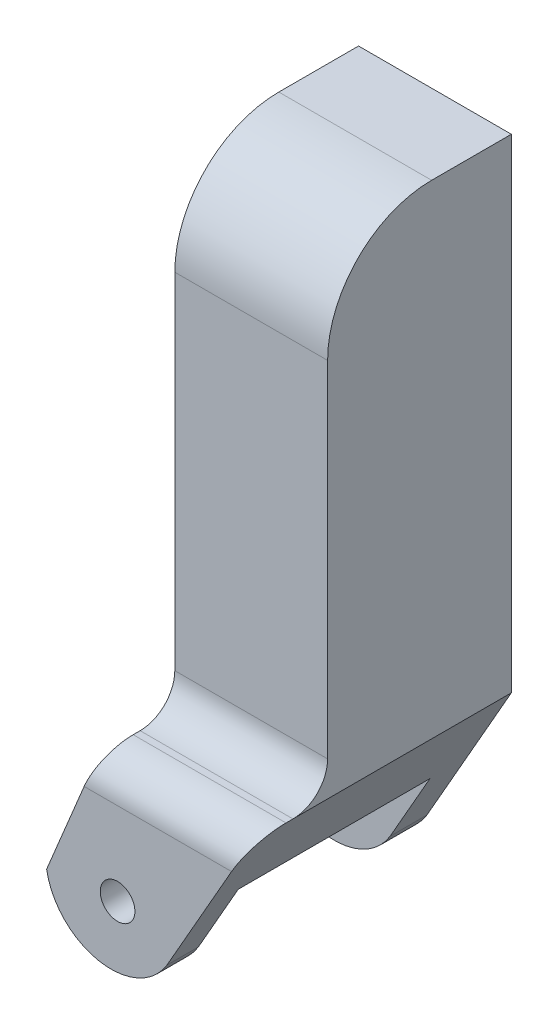
ISO-10303-21;
HEADER;
FILE_DESCRIPTION(('STEP AP214'),'2;1');
FILE_NAME('part.step','',(''),(''),'','','');
FILE_SCHEMA(('AUTOMOTIVE_DESIGN { 1 0 10303 214 1 1 1 1 }'));
ENDSEC;
DATA;
#1=APPLICATION_CONTEXT('core data for automotive mechanical design processes');
#2=APPLICATION_PROTOCOL_DEFINITION('international standard','automotive_design',2000,#1);
#3=PRODUCT_CONTEXT('',#1,'mechanical');
#4=PRODUCT('Part','Part','',(#3));
#5=PRODUCT_RELATED_PRODUCT_CATEGORY('part','',(#4));
#6=PRODUCT_DEFINITION_FORMATION('','',#4);
#7=PRODUCT_DEFINITION_CONTEXT('part definition',#1,'design');
#8=PRODUCT_DEFINITION('design','',#6,#7);
#9=PRODUCT_DEFINITION_SHAPE('','',#8);
#10=(LENGTH_UNIT() NAMED_UNIT(*) SI_UNIT(.MILLI.,.METRE.));
#11=(NAMED_UNIT(*) PLANE_ANGLE_UNIT() SI_UNIT($,.RADIAN.));
#12=(NAMED_UNIT(*) SI_UNIT($,.STERADIAN.) SOLID_ANGLE_UNIT());
#13=UNCERTAINTY_MEASURE_WITH_UNIT(LENGTH_MEASURE(1.E-05),#10,'distance_accuracy_value','');
#14=(GEOMETRIC_REPRESENTATION_CONTEXT(3) GLOBAL_UNCERTAINTY_ASSIGNED_CONTEXT((#13)) GLOBAL_UNIT_ASSIGNED_CONTEXT((#10,
#11,#12)) REPRESENTATION_CONTEXT('',''));
#15=CARTESIAN_POINT('',(0.,0.,0.));
#16=DIRECTION('',(0.,0.,1.));
#17=DIRECTION('',(1.,0.,0.));
#18=AXIS2_PLACEMENT_3D('',#15,#16,#17);
#19=CARTESIAN_POINT('',(-32.8848789360729,-92.7216774639358,53.));
#20=DIRECTION('',(0.,0.,-1.));
#21=DIRECTION('',(-1.,0.,0.));
#22=AXIS2_PLACEMENT_3D('',#19,#20,#21);
#23=CYLINDRICAL_SURFACE('',#22,18.8454114946771);
#24=DIRECTION('',(0.,0.,-1.));
#25=VECTOR('',#24,1.);
#26=CARTESIAN_POINT('',(-16.7914518301271,-102.527346150431,53.));
#27=LINE('',#26,#25);
#28=CARTESIAN_POINT('',(-16.7914518301271,-102.527346150431,10.6228361222349));
#29=VERTEX_POINT('',#28);
#30=CARTESIAN_POINT('',(-16.7914518301271,-102.527346150431,0.));
#31=VERTEX_POINT('',#30);
#32=EDGE_CURVE('E236',#29,#31,#27,.T.);
#33=ORIENTED_EDGE('',*,*,#32,.F.);
#34=CARTESIAN_POINT('',(-32.8848789360729,-92.7216774639358,10.6228361222349));
#35=DIRECTION('',(0.,0.,-1.));
#36=DIRECTION('',(-1.,0.,0.));
#37=AXIS2_PLACEMENT_3D('',#34,#35,#36);
#38=CIRCLE('',#37,18.8454114946771);
#39=CARTESIAN_POINT('',(-51.4654601740428,-95.8699365483993,10.6228361222349));
#40=VERTEX_POINT('',#39);
#41=EDGE_CURVE('E175',#29,#40,#38,.T.);
#42=ORIENTED_EDGE('',*,*,#41,.T.);
#43=DIRECTION('',(0.,0.,-1.));
#44=VECTOR('',#43,1.);
#45=CARTESIAN_POINT('',(-51.4654601740428,-95.8699365483993,53.));
#46=LINE('',#45,#44);
#47=CARTESIAN_POINT('',(-51.4654601740428,-95.8699365483993,0.));
#48=VERTEX_POINT('',#47);
#49=EDGE_CURVE('E241',#40,#48,#46,.T.);
#50=ORIENTED_EDGE('',*,*,#49,.T.);
#51=CARTESIAN_POINT('',(-32.8848789360729,-92.7216774639358,0.));
#52=DIRECTION('',(0.,0.,1.));
#53=DIRECTION('',(1.,0.,0.));
#54=AXIS2_PLACEMENT_3D('',#51,#52,#53);
#55=CIRCLE('',#54,18.8454114946771);
#56=EDGE_CURVE('E213',#48,#31,#55,.T.);
#57=ORIENTED_EDGE('',*,*,#56,.T.);
#58=EDGE_LOOP('',(#33,#42,#50,#57));
#59=FACE_BOUND('',#58,.T.);
#60=ADVANCED_FACE('F40',(#59),#23,.T.);
#61=CARTESIAN_POINT('',(-32.8848789360729,-92.7216774639358,53.));
#62=DIRECTION('',(0.,0.,1.));
#63=DIRECTION('',(1.,0.,0.));
#64=AXIS2_PLACEMENT_3D('',#61,#62,#63);
#65=PLANE('',#64);
#66=DIRECTION('',(0.,1.,0.));
#67=VECTOR('',#66,1.);
#68=CARTESIAN_POINT('',(7.58018465440707,79.732312661171,53.));
#69=LINE('',#68,#67);
#70=CARTESIAN_POINT('',(7.58018465440707,-49.7992344958783,53.));
#71=VERTEX_POINT('',#70);
#72=CARTESIAN_POINT('',(7.58018465440707,49.732312661171,53.));
#73=VERTEX_POINT('',#72);
#74=EDGE_CURVE('E200',#71,#73,#69,.T.);
#75=ORIENTED_EDGE('',*,*,#74,.T.);
#76=DIRECTION('',(-1.,0.,0.));
#77=VECTOR('',#76,1.);
#78=CARTESIAN_POINT('',(-36.4971853730712,49.732312661171,53.));
#79=LINE('',#78,#77);
#80=CARTESIAN_POINT('',(-36.4971853730712,49.732312661171,53.));
#81=VERTEX_POINT('',#80);
#82=EDGE_CURVE('E287',#73,#81,#79,.T.);
#83=ORIENTED_EDGE('',*,*,#82,.T.);
#84=DIRECTION('',(0.,-1.,0.));
#85=VECTOR('',#84,1.);
#86=CARTESIAN_POINT('',(-36.4971853730712,79.732312661171,53.));
#87=LINE('',#86,#85);
#88=CARTESIAN_POINT('',(-36.4971853730712,-49.7992344958783,53.));
#89=VERTEX_POINT('',#88);
#90=EDGE_CURVE('E197',#81,#89,#87,.T.);
#91=ORIENTED_EDGE('',*,*,#90,.T.);
#92=DIRECTION('',(1.,0.,0.));
#93=VECTOR('',#92,1.);
#94=CARTESIAN_POINT('',(7.58018465440707,-49.7992344958783,53.));
#95=LINE('',#94,#93);
#96=EDGE_CURVE('E249',#89,#71,#95,.T.);
#97=ORIENTED_EDGE('',*,*,#96,.T.);
#98=EDGE_LOOP('',(#75,#83,#91,#97));
#99=FACE_BOUND('',#98,.T.);
#100=ADVANCED_FACE('F345',(#99),#65,.T.);
#101=CARTESIAN_POINT('',(-36.4971853730712,79.732312661171,53.));
#102=DIRECTION('',(1.,0.,0.));
#103=DIRECTION('',(0.,0.,-1.));
#104=AXIS2_PLACEMENT_3D('',#101,#102,#103);
#105=PLANE('',#104);
#106=ORIENTED_EDGE('',*,*,#90,.F.);
#107=CARTESIAN_POINT('',(-36.4971853730712,49.732312661171,23.));
#108=DIRECTION('',(1.,0.,0.));
#109=DIRECTION('',(0.,0.,-1.));
#110=AXIS2_PLACEMENT_3D('',#107,#108,#109);
#111=CIRCLE('',#110,30.);
#112=CARTESIAN_POINT('',(-36.4971853730712,79.732312661171,23.));
#113=VERTEX_POINT('',#112);
#114=EDGE_CURVE('E63',#81,#113,#111,.F.);
#115=ORIENTED_EDGE('',*,*,#114,.T.);
#116=DIRECTION('',(0.,0.,-1.));
#117=VECTOR('',#116,1.);
#118=CARTESIAN_POINT('',(-36.4971853730712,79.732312661171,53.));
#119=LINE('',#118,#117);
#120=CARTESIAN_POINT('',(-36.4971853730712,79.732312661171,0.));
#121=VERTEX_POINT('',#120);
#122=EDGE_CURVE('E205',#113,#121,#119,.T.);
#123=ORIENTED_EDGE('',*,*,#122,.T.);
#124=DIRECTION('',(0.,-1.,0.));
#125=VECTOR('',#124,1.);
#126=CARTESIAN_POINT('',(-36.4971853730712,79.732312661171,0.));
#127=LINE('',#126,#125);
#128=CARTESIAN_POINT('',(-36.4971853730712,-59.7992344958783,0.));
#129=VERTEX_POINT('',#128);
#130=EDGE_CURVE('E196',#121,#129,#127,.T.);
#131=ORIENTED_EDGE('',*,*,#130,.T.);
#132=DIRECTION('',(0.,0.,-1.));
#133=VECTOR('',#132,1.);
#134=CARTESIAN_POINT('',(-36.4971853730712,-59.7992344958783,53.));
#135=LINE('',#134,#133);
#136=CARTESIAN_POINT('',(-36.4971853730712,-59.7992344958783,63.));
#137=VERTEX_POINT('',#136);
#138=EDGE_CURVE('E245',#137,#129,#135,.T.);
#139=ORIENTED_EDGE('',*,*,#138,.F.);
#140=CARTESIAN_POINT('',(-36.4971853730712,-49.7992344958783,63.));
#141=DIRECTION('',(1.,0.,0.));
#142=DIRECTION('',(0.,0.,-1.));
#143=AXIS2_PLACEMENT_3D('',#140,#141,#142);
#144=CIRCLE('',#143,10.);
#145=EDGE_CURVE('E261',#137,#89,#144,.T.);
#146=ORIENTED_EDGE('',*,*,#145,.T.);
#147=EDGE_LOOP('',(#106,#115,#123,#131,#139,#146));
#148=FACE_BOUND('',#147,.T.);
#149=ADVANCED_FACE('F342',(#148),#105,.F.);
#150=CARTESIAN_POINT('',(-36.4971853730712,-59.7992344958783,53.));
#151=DIRECTION('',(0.923632181667743,-0.383280045120647,0.));
#152=DIRECTION('',(0.383280045120647,0.923632181667743,0.));
#153=AXIS2_PLACEMENT_3D('',#150,#151,#152);
#154=PLANE('',#153);
#155=ORIENTED_EDGE('',*,*,#49,.F.);
#156=DIRECTION('',(-0.383280045120647,-0.923632181667743,0.));
#157=VECTOR('',#156,1.);
#158=CARTESIAN_POINT('',(-39.8919841927083,-67.9800554909225,10.6228361222349));
#159=LINE('',#158,#157);
#160=CARTESIAN_POINT('',(-39.8919841927083,-67.9800554909225,10.6228361222349));
#161=VERTEX_POINT('',#160);
#162=EDGE_CURVE('E163',#161,#40,#159,.T.);
#163=ORIENTED_EDGE('',*,*,#162,.F.);
#164=DIRECTION('',(0.,0.,-1.));
#165=VECTOR('',#164,1.);
#166=CARTESIAN_POINT('',(-39.8919841927083,-67.9800554909225,10.6228361222349));
#167=LINE('',#166,#165);
#168=CARTESIAN_POINT('',(-39.8919841927083,-67.9800554909225,65.9272028664468));
#169=VERTEX_POINT('',#168);
#170=EDGE_CURVE('E145',#169,#161,#167,.T.);
#171=ORIENTED_EDGE('',*,*,#170,.F.);
#172=DIRECTION('',(0.383280045120647,0.923632181667743,0.));
#173=VECTOR('',#172,1.);
#174=CARTESIAN_POINT('',(-39.8919841927083,-67.9800554909225,65.9272028664468));
#175=LINE('',#174,#173);
#176=CARTESIAN_POINT('',(-51.4654601740428,-95.8699365483993,65.9272028664468));
#177=VERTEX_POINT('',#176);
#178=EDGE_CURVE('E155',#177,#169,#175,.T.);
#179=ORIENTED_EDGE('',*,*,#178,.F.);
#180=CARTESIAN_POINT('',(-51.4654601740428,-95.8699365483993,75.));
#181=VERTEX_POINT('',#180);
#182=EDGE_CURVE('E242',#181,#177,#46,.T.);
#183=ORIENTED_EDGE('',*,*,#182,.F.);
#184=DIRECTION('',(-0.383280045120647,-0.923632181667743,0.));
#185=VECTOR('',#184,1.);
#186=CARTESIAN_POINT('',(-9.96610360476168,4.13563831482455,75.));
#187=LINE('',#186,#185);
#188=CARTESIAN_POINT('',(-40.6468896896595,-69.7992344958783,75.));
#189=VERTEX_POINT('',#188);
#190=EDGE_CURVE('E179',#189,#181,#187,.T.);
#191=ORIENTED_EDGE('',*,*,#190,.F.);
#192=CARTESIAN_POINT('',(-40.6468896896595,-69.7992344958783,65.));
#193=DIRECTION('',(0.923632181667743,-0.383280045120647,0.));
#194=DIRECTION('',(0.383280045120647,0.923632181667743,0.));
#195=AXIS2_PLACEMENT_3D('',#192,#193,#194);
#196=ELLIPSE('',#195,10.8268206743767,10.);
#197=CARTESIAN_POINT('',(-36.4971853730712,-59.7992344958783,65.));
#198=VERTEX_POINT('',#197);
#199=EDGE_CURVE('E275',#189,#198,#196,.F.);
#200=ORIENTED_EDGE('',*,*,#199,.T.);
#201=DIRECTION('',(0.,0.,-1.));
#202=VECTOR('',#201,1.);
#203=CARTESIAN_POINT('',(-36.4971853730712,-59.7992344958783,75.));
#204=LINE('',#203,#202);
#205=EDGE_CURVE('E193',#198,#137,#204,.T.);
#206=ORIENTED_EDGE('',*,*,#205,.T.);
#207=ORIENTED_EDGE('',*,*,#138,.T.);
#208=DIRECTION('',(-0.383280045120647,-0.923632181667743,0.));
#209=VECTOR('',#208,1.);
#210=CARTESIAN_POINT('',(-36.4971853730712,-59.7992344958783,0.));
#211=LINE('',#210,#209);
#212=EDGE_CURVE('E209',#129,#48,#211,.T.);
#213=ORIENTED_EDGE('',*,*,#212,.T.);
#214=EDGE_LOOP('',(#155,#163,#171,#179,#183,#191,#200,#206,#207,#213));
#215=FACE_BOUND('',#214,.T.);
#216=ADVANCED_FACE('F166',(#215),#154,.F.);
#217=ORIENTED_EDGE('',*,*,#182,.T.);
#218=CARTESIAN_POINT('',(-32.8848789360729,-92.7216774639358,65.9272028664468));
#219=DIRECTION('',(0.,0.,1.));
#220=DIRECTION('',(1.,0.,0.));
#221=AXIS2_PLACEMENT_3D('',#218,#219,#220);
#222=CIRCLE('',#221,18.8454114946771);
#223=CARTESIAN_POINT('',(-16.7914518301271,-102.527346150431,65.9272028664468));
#224=VERTEX_POINT('',#223);
#225=EDGE_CURVE('E158',#177,#224,#222,.T.);
#226=ORIENTED_EDGE('',*,*,#225,.T.);
#227=CARTESIAN_POINT('',(-16.7914518301271,-102.527346150431,75.));
#228=VERTEX_POINT('',#227);
#229=EDGE_CURVE('E237',#228,#224,#27,.T.);
#230=ORIENTED_EDGE('',*,*,#229,.F.);
#231=CARTESIAN_POINT('',(-32.8848789360729,-92.7216774639358,75.));
#232=DIRECTION('',(0.,0.,1.));
#233=DIRECTION('',(1.,0.,0.));
#234=AXIS2_PLACEMENT_3D('',#231,#232,#233);
#235=CIRCLE('',#234,18.8454114946771);
#236=EDGE_CURVE('E182',#181,#228,#235,.T.);
#237=ORIENTED_EDGE('',*,*,#236,.F.);
#238=EDGE_LOOP('',(#217,#226,#230,#237));
#239=FACE_BOUND('',#238,.T.);
#240=ADVANCED_FACE('F334',(#239),#23,.T.);
#241=CARTESIAN_POINT('',(7.58018465440707,-59.7992344958783,53.));
#242=DIRECTION('',(-0.86863193542156,0.495457930369264,0.));
#243=DIRECTION('',(-0.495457930369264,-0.86863193542156,0.));
#244=AXIS2_PLACEMENT_3D('',#241,#242,#243);
#245=PLANE('',#244);
#246=DIRECTION('',(0.,0.,-1.));
#247=VECTOR('',#246,1.);
#248=CARTESIAN_POINT('',(-5.27881128516762,-82.3434987934463,53.));
#249=LINE('',#248,#247);
#250=CARTESIAN_POINT('',(-5.27881128516762,-82.3434987934463,65.9272028664468));
#251=VERTEX_POINT('',#250);
#252=CARTESIAN_POINT('',(-5.27881128516762,-82.3434987934463,10.6228361222349));
#253=VERTEX_POINT('',#252);
#254=EDGE_CURVE('E148',#251,#253,#249,.T.);
#255=ORIENTED_EDGE('',*,*,#254,.T.);
#256=DIRECTION('',(-0.495457930369264,-0.86863193542156,0.));
#257=VECTOR('',#256,1.);
#258=CARTESIAN_POINT('',(7.58018465440707,-59.7992344958783,10.6228361222349));
#259=LINE('',#258,#257);
#260=EDGE_CURVE('E283',#253,#29,#259,.T.);
#261=ORIENTED_EDGE('',*,*,#260,.T.);
#262=ORIENTED_EDGE('',*,*,#32,.T.);
#263=DIRECTION('',(0.495457930369264,0.86863193542156,0.));
#264=VECTOR('',#263,1.);
#265=CARTESIAN_POINT('',(7.58018465440707,-59.7992344958783,0.));
#266=LINE('',#265,#264);
#267=CARTESIAN_POINT('',(7.58018465440707,-59.7992344958783,0.));
#268=VERTEX_POINT('',#267);
#269=EDGE_CURVE('E217',#31,#268,#266,.T.);
#270=ORIENTED_EDGE('',*,*,#269,.T.);
#271=DIRECTION('',(0.,0.,-1.));
#272=VECTOR('',#271,1.);
#273=CARTESIAN_POINT('',(7.58018465440707,-59.7992344958783,53.));
#274=LINE('',#273,#272);
#275=CARTESIAN_POINT('',(7.58018465440707,-59.7992344958783,63.));
#276=VERTEX_POINT('',#275);
#277=EDGE_CURVE('E232',#276,#268,#274,.T.);
#278=ORIENTED_EDGE('',*,*,#277,.F.);
#279=DIRECTION('',(0.,0.,-1.));
#280=VECTOR('',#279,1.);
#281=CARTESIAN_POINT('',(7.58018465440707,-59.7992344958783,75.));
#282=LINE('',#281,#280);
#283=CARTESIAN_POINT('',(7.58018465440707,-59.7992344958783,65.));
#284=VERTEX_POINT('',#283);
#285=EDGE_CURVE('E190',#284,#276,#282,.T.);
#286=ORIENTED_EDGE('',*,*,#285,.F.);
#287=CARTESIAN_POINT('',(1.87629661892044,-69.7992344958783,65.));
#288=DIRECTION('',(-0.86863193542156,0.495457930369264,0.));
#289=DIRECTION('',(0.495457930369264,0.86863193542156,0.));
#290=AXIS2_PLACEMENT_3D('',#287,#288,#289);
#291=ELLIPSE('',#290,11.5123559153358,10.);
#292=CARTESIAN_POINT('',(1.87629661892043,-69.7992344958783,75.));
#293=VERTEX_POINT('',#292);
#294=EDGE_CURVE('E269',#284,#293,#291,.F.);
#295=ORIENTED_EDGE('',*,*,#294,.T.);
#296=DIRECTION('',(0.495457930369264,0.86863193542156,0.));
#297=VECTOR('',#296,1.);
#298=CARTESIAN_POINT('',(31.4552431270522,-17.9417184925716,75.));
#299=LINE('',#298,#297);
#300=EDGE_CURVE('E186',#228,#293,#299,.T.);
#301=ORIENTED_EDGE('',*,*,#300,.F.);
#302=ORIENTED_EDGE('',*,*,#229,.T.);
#303=DIRECTION('',(0.495457930369264,0.86863193542156,0.));
#304=VECTOR('',#303,1.);
#305=CARTESIAN_POINT('',(7.58018465440707,-59.7992344958783,65.9272028664468));
#306=LINE('',#305,#304);
#307=EDGE_CURVE('E278',#224,#251,#306,.T.);
#308=ORIENTED_EDGE('',*,*,#307,.T.);
#309=EDGE_LOOP('',(#255,#261,#262,#270,#278,#286,#295,#301,#302,#308));
#310=FACE_BOUND('',#309,.T.);
#311=ADVANCED_FACE('F303',(#310),#245,.F.);
#312=CARTESIAN_POINT('',(7.58018465440707,79.732312661171,53.));
#313=DIRECTION('',(-1.,0.,0.));
#314=DIRECTION('',(0.,0.,1.));
#315=AXIS2_PLACEMENT_3D('',#312,#313,#314);
#316=PLANE('',#315);
#317=DIRECTION('',(0.,0.,-1.));
#318=VECTOR('',#317,1.);
#319=CARTESIAN_POINT('',(7.58018465440707,79.732312661171,53.));
#320=LINE('',#319,#318);
#321=CARTESIAN_POINT('',(7.58018465440707,79.732312661171,23.));
#322=VERTEX_POINT('',#321);
#323=CARTESIAN_POINT('',(7.58018465440707,79.732312661171,0.));
#324=VERTEX_POINT('',#323);
#325=EDGE_CURVE('E229',#322,#324,#320,.T.);
#326=ORIENTED_EDGE('',*,*,#325,.F.);
#327=CARTESIAN_POINT('',(7.58018465440707,49.732312661171,23.));
#328=DIRECTION('',(-1.,0.,0.));
#329=DIRECTION('',(0.,0.,1.));
#330=AXIS2_PLACEMENT_3D('',#327,#328,#329);
#331=CIRCLE('',#330,30.);
#332=EDGE_CURVE('E11',#322,#73,#331,.F.);
#333=ORIENTED_EDGE('',*,*,#332,.T.);
#334=ORIENTED_EDGE('',*,*,#74,.F.);
#335=CARTESIAN_POINT('',(7.58018465440707,-49.7992344958783,63.));
#336=DIRECTION('',(-1.,0.,0.));
#337=DIRECTION('',(0.,0.,1.));
#338=AXIS2_PLACEMENT_3D('',#335,#336,#337);
#339=CIRCLE('',#338,10.);
#340=EDGE_CURVE('E257',#71,#276,#339,.T.);
#341=ORIENTED_EDGE('',*,*,#340,.T.);
#342=ORIENTED_EDGE('',*,*,#277,.T.);
#343=DIRECTION('',(0.,1.,0.));
#344=VECTOR('',#343,1.);
#345=CARTESIAN_POINT('',(7.58018465440707,79.732312661171,0.));
#346=LINE('',#345,#344);
#347=EDGE_CURVE('E220',#268,#324,#346,.T.);
#348=ORIENTED_EDGE('',*,*,#347,.T.);
#349=EDGE_LOOP('',(#326,#333,#334,#341,#342,#348));
#350=FACE_BOUND('',#349,.T.);
#351=ADVANCED_FACE('F314',(#350),#316,.F.);
#352=CARTESIAN_POINT('',(-36.4971853730712,79.732312661171,53.));
#353=DIRECTION('',(0.,-1.,0.));
#354=DIRECTION('',(0.,0.,-1.));
#355=AXIS2_PLACEMENT_3D('',#352,#353,#354);
#356=PLANE('',#355);
#357=ORIENTED_EDGE('',*,*,#122,.F.);
#358=DIRECTION('',(-1.,0.,0.));
#359=VECTOR('',#358,1.);
#360=CARTESIAN_POINT('',(7.58018465440707,79.732312661171,23.));
#361=LINE('',#360,#359);
#362=EDGE_CURVE('E49',#113,#322,#361,.F.);
#363=ORIENTED_EDGE('',*,*,#362,.T.);
#364=ORIENTED_EDGE('',*,*,#325,.T.);
#365=DIRECTION('',(-1.,0.,0.));
#366=VECTOR('',#365,1.);
#367=CARTESIAN_POINT('',(-36.4971853730712,79.732312661171,0.));
#368=LINE('',#367,#366);
#369=EDGE_CURVE('E201',#324,#121,#368,.T.);
#370=ORIENTED_EDGE('',*,*,#369,.T.);
#371=EDGE_LOOP('',(#357,#363,#364,#370));
#372=FACE_BOUND('',#371,.T.);
#373=ADVANCED_FACE('F361',(#372),#356,.F.);
#374=CARTESIAN_POINT('',(-32.8848789360729,-92.7216774639358,0.));
#375=DIRECTION('',(0.,0.,1.));
#376=DIRECTION('',(1.,0.,0.));
#377=AXIS2_PLACEMENT_3D('',#374,#375,#376);
#378=PLANE('',#377);
#379=CARTESIAN_POINT('',(-15.1734326458777,61.131642173345,0.));
#380=DIRECTION('',(0.,0.,-1.));
#381=DIRECTION('',(-1.,0.,0.));
#382=AXIS2_PLACEMENT_3D('',#379,#380,#381);
#383=CIRCLE('',#382,5.);
#384=CARTESIAN_POINT('',(-20.1734326458777,61.131642173345,0.));
#385=VERTEX_POINT('',#384);
#386=EDGE_CURVE('E554',#385,#385,#383,.T.);
#387=ORIENTED_EDGE('',*,*,#386,.F.);
#388=EDGE_LOOP('',(#387));
#389=FACE_BOUND('',#388,.T.);
#390=CARTESIAN_POINT('',(-31.0074169384469,-93.6984369775861,0.));
#391=DIRECTION('',(0.,0.,1.));
#392=DIRECTION('',(1.,0.,0.));
#393=AXIS2_PLACEMENT_3D('',#390,#391,#392);
#394=CIRCLE('',#393,5.);
#395=CARTESIAN_POINT('',(-26.0074169384469,-93.6984369775861,0.));
#396=VERTEX_POINT('',#395);
#397=EDGE_CURVE('E293',#396,#396,#394,.F.);
#398=ORIENTED_EDGE('',*,*,#397,.F.);
#399=EDGE_LOOP('',(#398));
#400=FACE_BOUND('',#399,.T.);
#401=ORIENTED_EDGE('',*,*,#130,.F.);
#402=ORIENTED_EDGE('',*,*,#369,.F.);
#403=ORIENTED_EDGE('',*,*,#347,.F.);
#404=ORIENTED_EDGE('',*,*,#269,.F.);
#405=ORIENTED_EDGE('',*,*,#56,.F.);
#406=ORIENTED_EDGE('',*,*,#212,.F.);
#407=EDGE_LOOP('',(#401,#402,#403,#404,#405,#406));
#408=FACE_BOUND('',#407,.T.);
#409=ADVANCED_FACE('F311',(#389,#400,#408),#378,.F.);
#410=CARTESIAN_POINT('',(0.,-59.7992344958783,75.));
#411=DIRECTION('',(0.,1.,0.));
#412=DIRECTION('',(0.,0.,1.));
#413=AXIS2_PLACEMENT_3D('',#410,#411,#412);
#414=PLANE('',#413);
#415=ORIENTED_EDGE('',*,*,#205,.F.);
#416=DIRECTION('',(1.,0.,0.));
#417=VECTOR('',#416,1.);
#418=CARTESIAN_POINT('',(0.,-59.7992344958783,65.));
#419=LINE('',#418,#417);
#420=EDGE_CURVE('E265',#198,#284,#419,.T.);
#421=ORIENTED_EDGE('',*,*,#420,.T.);
#422=ORIENTED_EDGE('',*,*,#285,.T.);
#423=DIRECTION('',(1.,0.,0.));
#424=VECTOR('',#423,1.);
#425=CARTESIAN_POINT('',(-36.4971853730712,-59.7992344958783,63.));
#426=LINE('',#425,#424);
#427=EDGE_CURVE('E253',#276,#137,#426,.F.);
#428=ORIENTED_EDGE('',*,*,#427,.T.);
#429=EDGE_LOOP('',(#415,#421,#422,#428));
#430=FACE_BOUND('',#429,.T.);
#431=ADVANCED_FACE('F322',(#430),#414,.T.);
#432=CARTESIAN_POINT('',(0.,0.,75.));
#433=DIRECTION('',(0.,0.,1.));
#434=DIRECTION('',(1.,0.,0.));
#435=AXIS2_PLACEMENT_3D('',#432,#433,#434);
#436=PLANE('',#435);
#437=CARTESIAN_POINT('',(-31.0074169384469,-93.6984369775861,75.));
#438=DIRECTION('',(0.,0.,1.));
#439=DIRECTION('',(1.,0.,0.));
#440=AXIS2_PLACEMENT_3D('',#437,#438,#439);
#441=CIRCLE('',#440,5.);
#442=CARTESIAN_POINT('',(-26.0074169384469,-93.6984369775861,75.));
#443=VERTEX_POINT('',#442);
#444=EDGE_CURVE('E545',#443,#443,#441,.T.);
#445=ORIENTED_EDGE('',*,*,#444,.F.);
#446=EDGE_LOOP('',(#445));
#447=FACE_BOUND('',#446,.T.);
#448=ORIENTED_EDGE('',*,*,#300,.T.);
#449=DIRECTION('',(1.,0.,0.));
#450=VECTOR('',#449,1.);
#451=CARTESIAN_POINT('',(0.,-69.7992344958783,75.));
#452=LINE('',#451,#450);
#453=EDGE_CURVE('E272',#293,#189,#452,.F.);
#454=ORIENTED_EDGE('',*,*,#453,.T.);
#455=ORIENTED_EDGE('',*,*,#190,.T.);
#456=ORIENTED_EDGE('',*,*,#236,.T.);
#457=EDGE_LOOP('',(#448,#454,#455,#456));
#458=FACE_BOUND('',#457,.T.);
#459=ADVANCED_FACE('F331',(#447,#458),#436,.T.);
#460=CARTESIAN_POINT('',(-32.8848789360729,-49.7992344958783,63.));
#461=DIRECTION('',(-1.,0.,0.));
#462=DIRECTION('',(0.,0.,1.));
#463=AXIS2_PLACEMENT_3D('',#460,#461,#462);
#464=CYLINDRICAL_SURFACE('',#463,10.);
#465=ORIENTED_EDGE('',*,*,#145,.F.);
#466=ORIENTED_EDGE('',*,*,#427,.F.);
#467=ORIENTED_EDGE('',*,*,#340,.F.);
#468=ORIENTED_EDGE('',*,*,#96,.F.);
#469=EDGE_LOOP('',(#465,#466,#467,#468));
#470=FACE_BOUND('',#469,.T.);
#471=ADVANCED_FACE('F442',(#470),#464,.F.);
#472=CARTESIAN_POINT('',(0.,-69.7992344958783,65.));
#473=DIRECTION('',(1.,0.,0.));
#474=DIRECTION('',(0.,0.,-1.));
#475=AXIS2_PLACEMENT_3D('',#472,#473,#474);
#476=CYLINDRICAL_SURFACE('',#475,10.);
#477=ORIENTED_EDGE('',*,*,#199,.F.);
#478=ORIENTED_EDGE('',*,*,#453,.F.);
#479=ORIENTED_EDGE('',*,*,#294,.F.);
#480=ORIENTED_EDGE('',*,*,#420,.F.);
#481=EDGE_LOOP('',(#477,#478,#479,#480));
#482=FACE_BOUND('',#481,.T.);
#483=ADVANCED_FACE('F327',(#482),#476,.T.);
#484=CARTESIAN_POINT('',(11.8314179806852,-89.4437380176788,10.6228361222349));
#485=DIRECTION('',(0.,0.,-1.));
#486=DIRECTION('',(-1.,0.,0.));
#487=AXIS2_PLACEMENT_3D('',#484,#485,#486);
#488=PLANE('',#487);
#489=CARTESIAN_POINT('',(-31.0074169384469,-93.6984369775861,10.6228361222349));
#490=DIRECTION('',(0.,0.,-1.));
#491=DIRECTION('',(-1.,0.,0.));
#492=AXIS2_PLACEMENT_3D('',#489,#490,#491);
#493=CIRCLE('',#492,5.);
#494=CARTESIAN_POINT('',(-36.0074169384469,-93.6984369775861,10.6228361222349));
#495=VERTEX_POINT('',#494);
#496=EDGE_CURVE('E292',#495,#495,#493,.T.);
#497=ORIENTED_EDGE('',*,*,#496,.T.);
#498=EDGE_LOOP('',(#497));
#499=FACE_BOUND('',#498,.T.);
#500=ORIENTED_EDGE('',*,*,#260,.F.);
#501=DIRECTION('',(-0.923632181667743,0.383280045120648,0.));
#502=VECTOR('',#501,1.);
#503=CARTESIAN_POINT('',(11.8314179806852,-89.4437380176788,10.6228361222349));
#504=LINE('',#503,#502);
#505=EDGE_CURVE('E152',#253,#161,#504,.T.);
#506=ORIENTED_EDGE('',*,*,#505,.T.);
#507=ORIENTED_EDGE('',*,*,#162,.T.);
#508=ORIENTED_EDGE('',*,*,#41,.F.);
#509=EDGE_LOOP('',(#500,#506,#507,#508));
#510=FACE_BOUND('',#509,.T.);
#511=ADVANCED_FACE('F427',(#499,#510),#488,.F.);
#512=CARTESIAN_POINT('',(11.8314179806852,-89.4437380176788,10.6228361222349));
#513=DIRECTION('',(0.383280045120648,0.923632181667743,0.));
#514=DIRECTION('',(-0.923632181667743,0.383280045120648,0.));
#515=AXIS2_PLACEMENT_3D('',#512,#513,#514);
#516=PLANE('',#515);
#517=DIRECTION('',(-0.923632181667743,0.383280045120648,0.));
#518=VECTOR('',#517,1.);
#519=CARTESIAN_POINT('',(11.8314179806852,-89.4437380176788,65.9272028664468));
#520=LINE('',#519,#518);
#521=EDGE_CURVE('E140',#251,#169,#520,.T.);
#522=ORIENTED_EDGE('',*,*,#521,.T.);
#523=ORIENTED_EDGE('',*,*,#170,.T.);
#524=ORIENTED_EDGE('',*,*,#505,.F.);
#525=ORIENTED_EDGE('',*,*,#254,.F.);
#526=EDGE_LOOP('',(#522,#523,#524,#525));
#527=FACE_BOUND('',#526,.T.);
#528=ADVANCED_FACE('F142',(#527),#516,.F.);
#529=CARTESIAN_POINT('',(11.8314179806852,-89.4437380176788,65.9272028664468));
#530=DIRECTION('',(0.,0.,1.));
#531=DIRECTION('',(1.,0.,0.));
#532=AXIS2_PLACEMENT_3D('',#529,#530,#531);
#533=PLANE('',#532);
#534=CARTESIAN_POINT('',(-31.0074169384469,-93.6984369775861,65.9272028664468));
#535=DIRECTION('',(0.,0.,1.));
#536=DIRECTION('',(1.,0.,0.));
#537=AXIS2_PLACEMENT_3D('',#534,#535,#536);
#538=CIRCLE('',#537,5.);
#539=CARTESIAN_POINT('',(-26.0074169384469,-93.6984369775861,65.9272028664468));
#540=VERTEX_POINT('',#539);
#541=EDGE_CURVE('E288',#540,#540,#538,.T.);
#542=ORIENTED_EDGE('',*,*,#541,.T.);
#543=EDGE_LOOP('',(#542));
#544=FACE_BOUND('',#543,.T.);
#545=ORIENTED_EDGE('',*,*,#178,.T.);
#546=ORIENTED_EDGE('',*,*,#521,.F.);
#547=ORIENTED_EDGE('',*,*,#307,.F.);
#548=ORIENTED_EDGE('',*,*,#225,.F.);
#549=EDGE_LOOP('',(#545,#546,#547,#548));
#550=FACE_BOUND('',#549,.T.);
#551=ADVANCED_FACE('F156',(#544,#550),#533,.F.);
#552=CARTESIAN_POINT('',(-31.0074169384469,-93.6984369775861,-14.142135623731));
#553=DIRECTION('',(0.,0.,1.));
#554=DIRECTION('',(1.,0.,0.));
#555=AXIS2_PLACEMENT_3D('',#552,#553,#554);
#556=CYLINDRICAL_SURFACE('',#555,5.);
#557=ORIENTED_EDGE('',*,*,#444,.T.);
#558=EDGE_LOOP('',(#557));
#559=FACE_BOUND('',#558,.T.);
#560=ORIENTED_EDGE('',*,*,#541,.F.);
#561=EDGE_LOOP('',(#560));
#562=FACE_BOUND('',#561,.T.);
#563=ADVANCED_FACE('F405',(#559,#562),#556,.F.);
#564=ORIENTED_EDGE('',*,*,#397,.T.);
#565=EDGE_LOOP('',(#564));
#566=FACE_BOUND('',#565,.T.);
#567=ORIENTED_EDGE('',*,*,#496,.F.);
#568=EDGE_LOOP('',(#567));
#569=FACE_BOUND('',#568,.T.);
#570=ADVANCED_FACE('F396',(#566,#569),#556,.F.);
#571=CARTESIAN_POINT('',(-15.1734326458777,61.131642173345,9.99999999999994));
#572=DIRECTION('',(0.,0.,-1.));
#573=DIRECTION('',(-1.,0.,0.));
#574=AXIS2_PLACEMENT_3D('',#571,#572,#573);
#575=CYLINDRICAL_SURFACE('',#574,5.);
#576=CARTESIAN_POINT('',(-15.1734326458777,61.131642173345,9.99999999999994));
#577=DIRECTION('',(0.,0.,-1.));
#578=DIRECTION('',(-1.,0.,0.));
#579=AXIS2_PLACEMENT_3D('',#576,#577,#578);
#580=CIRCLE('',#579,5.);
#581=CARTESIAN_POINT('',(-20.1734326458777,61.131642173345,9.99999999999994));
#582=VERTEX_POINT('',#581);
#583=EDGE_CURVE('E547',#582,#582,#580,.T.);
#584=ORIENTED_EDGE('',*,*,#583,.F.);
#585=EDGE_LOOP('',(#584));
#586=FACE_BOUND('',#585,.T.);
#587=ORIENTED_EDGE('',*,*,#386,.T.);
#588=EDGE_LOOP('',(#587));
#589=FACE_BOUND('',#588,.T.);
#590=ADVANCED_FACE('F389',(#586,#589),#575,.F.);
#591=CARTESIAN_POINT('',(-15.1734326458777,61.131642173345,9.99999999999994));
#592=DIRECTION('',(0.,0.,-1.));
#593=DIRECTION('',(-1.,0.,0.));
#594=AXIS2_PLACEMENT_3D('',#591,#592,#593);
#595=PLANE('',#594);
#596=ORIENTED_EDGE('',*,*,#583,.T.);
#597=EDGE_LOOP('',(#596));
#598=FACE_BOUND('',#597,.T.);
#599=ADVANCED_FACE('F380',(#598),#595,.T.);
#600=CARTESIAN_POINT('',(-32.8848789360729,49.732312661171,23.));
#601=DIRECTION('',(1.,0.,0.));
#602=DIRECTION('',(0.,0.,-1.));
#603=AXIS2_PLACEMENT_3D('',#600,#601,#602);
#604=CYLINDRICAL_SURFACE('',#603,30.);
#605=ORIENTED_EDGE('',*,*,#332,.F.);
#606=ORIENTED_EDGE('',*,*,#362,.F.);
#607=ORIENTED_EDGE('',*,*,#114,.F.);
#608=ORIENTED_EDGE('',*,*,#82,.F.);
#609=EDGE_LOOP('',(#605,#606,#607,#608));
#610=FACE_BOUND('',#609,.T.);
#611=ADVANCED_FACE('F42',(#610),#604,.T.);
#612=CLOSED_SHELL('',(#60,#100,#149,#216,#240,#311,#351,#373,#409,#431,#459,#471,#483,#511,#528,
#551,#563,#570,#590,#599,#611));
#613=MANIFOLD_SOLID_BREP('B2',#612);
#614=ADVANCED_BREP_SHAPE_REPRESENTATION('',(#18,#613),#14);
#615=SHAPE_DEFINITION_REPRESENTATION(#9,#614);
ENDSEC;
END-ISO-10303-21;
